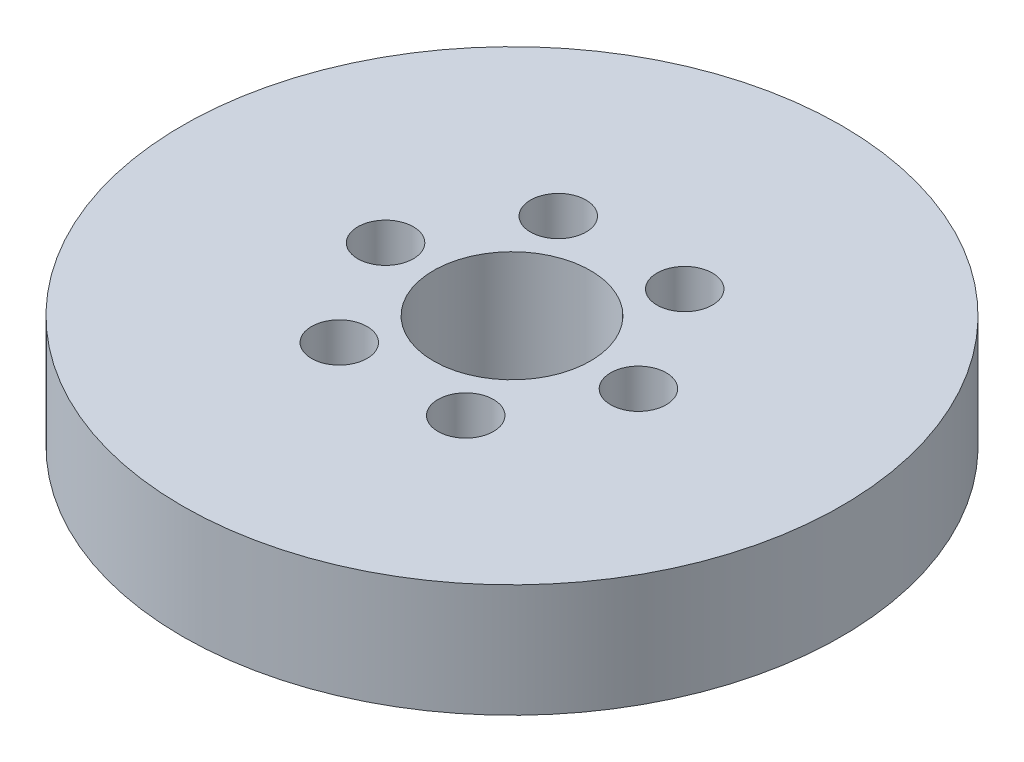
ISO-10303-21;
HEADER;
FILE_DESCRIPTION(('STEP AP214'),'2;1');
FILE_NAME('part.step','',(''),(''),'','','');
FILE_SCHEMA(('AUTOMOTIVE_DESIGN { 1 0 10303 214 1 1 1 1 }'));
ENDSEC;
DATA;
#1=APPLICATION_CONTEXT('core data for automotive mechanical design processes');
#2=APPLICATION_PROTOCOL_DEFINITION('international standard','automotive_design',2000,#1);
#3=PRODUCT_CONTEXT('',#1,'mechanical');
#4=PRODUCT('Part','Part','',(#3));
#5=PRODUCT_RELATED_PRODUCT_CATEGORY('part','',(#4));
#6=PRODUCT_DEFINITION_FORMATION('','',#4);
#7=PRODUCT_DEFINITION_CONTEXT('part definition',#1,'design');
#8=PRODUCT_DEFINITION('design','',#6,#7);
#9=PRODUCT_DEFINITION_SHAPE('','',#8);
#10=(LENGTH_UNIT() NAMED_UNIT(*) SI_UNIT(.MILLI.,.METRE.));
#11=(NAMED_UNIT(*) PLANE_ANGLE_UNIT() SI_UNIT($,.RADIAN.));
#12=(NAMED_UNIT(*) SI_UNIT($,.STERADIAN.) SOLID_ANGLE_UNIT());
#13=UNCERTAINTY_MEASURE_WITH_UNIT(LENGTH_MEASURE(1.E-05),#10,'distance_accuracy_value','');
#14=(GEOMETRIC_REPRESENTATION_CONTEXT(3) GLOBAL_UNCERTAINTY_ASSIGNED_CONTEXT((#13)) GLOBAL_UNIT_ASSIGNED_CONTEXT((#10,
#11,#12)) REPRESENTATION_CONTEXT('',''));
#15=CARTESIAN_POINT('',(0.,0.,0.));
#16=DIRECTION('',(0.,0.,1.));
#17=DIRECTION('',(1.,0.,0.));
#18=AXIS2_PLACEMENT_3D('',#15,#16,#17);
#19=CARTESIAN_POINT('',(0.,18.,0.));
#20=DIRECTION('',(0.,-1.,0.));
#21=DIRECTION('',(0.,0.,-1.));
#22=AXIS2_PLACEMENT_3D('',#19,#20,#21);
#23=CYLINDRICAL_SURFACE('',#22,52.5);
#24=CARTESIAN_POINT('',(0.,18.,0.));
#25=DIRECTION('',(0.,1.,0.));
#26=DIRECTION('',(0.,0.,1.));
#27=AXIS2_PLACEMENT_3D('',#24,#25,#26);
#28=CIRCLE('',#27,52.5);
#29=CARTESIAN_POINT('',(0.,18.,52.5));
#30=VERTEX_POINT('',#29);
#31=EDGE_CURVE('E10',#30,#30,#28,.T.);
#32=ORIENTED_EDGE('',*,*,#31,.F.);
#33=EDGE_LOOP('',(#32));
#34=FACE_BOUND('',#33,.T.);
#35=CARTESIAN_POINT('',(0.,0.,0.));
#36=DIRECTION('',(0.,1.,0.));
#37=DIRECTION('',(0.,0.,1.));
#38=AXIS2_PLACEMENT_3D('',#35,#36,#37);
#39=CIRCLE('',#38,52.5);
#40=CARTESIAN_POINT('',(0.,0.,52.5));
#41=VERTEX_POINT('',#40);
#42=EDGE_CURVE('E37',#41,#41,#39,.T.);
#43=ORIENTED_EDGE('',*,*,#42,.T.);
#44=EDGE_LOOP('',(#43));
#45=FACE_BOUND('',#44,.T.);
#46=ADVANCED_FACE('F40',(#34,#45),#23,.T.);
#47=CARTESIAN_POINT('',(0.,18.,0.));
#48=DIRECTION('',(0.,1.,0.));
#49=DIRECTION('',(0.,0.,1.));
#50=AXIS2_PLACEMENT_3D('',#47,#48,#49);
#51=PLANE('',#50);
#52=CARTESIAN_POINT('',(-10.0704465716138,18.,-17.4425251169424));
#53=DIRECTION('',(0.,1.,0.));
#54=DIRECTION('',(-0.866025403784433,0.,0.50000000000001));
#55=AXIS2_PLACEMENT_3D('',#52,#53,#54);
#56=CIRCLE('',#55,4.42404894616587);
#57=CARTESIAN_POINT('',(-13.9017853465792,18.,-15.2305006438594));
#58=VERTEX_POINT('',#57);
#59=EDGE_CURVE('E70',#58,#58,#56,.T.);
#60=ORIENTED_EDGE('',*,*,#59,.F.);
#61=EDGE_LOOP('',(#60));
#62=FACE_BOUND('',#61,.T.);
#63=CARTESIAN_POINT('',(10.0704465716134,18.,-17.4425251169426));
#64=DIRECTION('',(0.,1.,0.));
#65=DIRECTION('',(-0.866025403784443,0.,-0.499999999999992));
#66=AXIS2_PLACEMENT_3D('',#63,#64,#65);
#67=CIRCLE('',#66,4.42404894616587);
#68=CARTESIAN_POINT('',(6.23910779664797,18.,-19.6545495900255));
#69=VERTEX_POINT('',#68);
#70=EDGE_CURVE('E71',#69,#69,#67,.T.);
#71=ORIENTED_EDGE('',*,*,#70,.F.);
#72=EDGE_LOOP('',(#71));
#73=FACE_BOUND('',#72,.T.);
#74=CARTESIAN_POINT('',(20.1408931432271,18.,0.));
#75=DIRECTION('',(0.,1.,0.));
#76=DIRECTION('',(0.,0.,-1.));
#77=AXIS2_PLACEMENT_3D('',#74,#75,#76);
#78=CIRCLE('',#77,4.42404894616587);
#79=CARTESIAN_POINT('',(20.1408931432271,18.,-4.42404894616587));
#80=VERTEX_POINT('',#79);
#81=EDGE_CURVE('E78',#80,#80,#78,.T.);
#82=ORIENTED_EDGE('',*,*,#81,.F.);
#83=EDGE_LOOP('',(#82));
#84=FACE_BOUND('',#83,.T.);
#85=CARTESIAN_POINT('',(10.0704465716137,18.,17.4425251169425));
#86=DIRECTION('',(0.,1.,0.));
#87=DIRECTION('',(0.866025403784436,0.,-0.500000000000004));
#88=AXIS2_PLACEMENT_3D('',#85,#86,#87);
#89=CIRCLE('',#88,4.42404894616587);
#90=CARTESIAN_POINT('',(13.9017853465791,18.,15.2305006438595));
#91=VERTEX_POINT('',#90);
#92=EDGE_CURVE('E84',#91,#91,#89,.T.);
#93=ORIENTED_EDGE('',*,*,#92,.F.);
#94=EDGE_LOOP('',(#93));
#95=FACE_BOUND('',#94,.T.);
#96=CARTESIAN_POINT('',(-10.0704465716135,18.,17.4425251169425));
#97=DIRECTION('',(0.,1.,0.));
#98=DIRECTION('',(0.86602540378444,0.,0.499999999999998));
#99=AXIS2_PLACEMENT_3D('',#96,#97,#98);
#100=CIRCLE('',#99,4.42404894616587);
#101=CARTESIAN_POINT('',(-6.23910779664811,18.,19.6545495900255));
#102=VERTEX_POINT('',#101);
#103=EDGE_CURVE('E61',#102,#102,#100,.T.);
#104=ORIENTED_EDGE('',*,*,#103,.F.);
#105=EDGE_LOOP('',(#104));
#106=FACE_BOUND('',#105,.T.);
#107=CARTESIAN_POINT('',(-20.1408931432271,18.,0.));
#108=DIRECTION('',(0.,1.,0.));
#109=DIRECTION('',(0.,0.,1.));
#110=AXIS2_PLACEMENT_3D('',#107,#108,#109);
#111=CIRCLE('',#110,4.42404894616587);
#112=CARTESIAN_POINT('',(-20.1408931432271,18.,4.42404894616587));
#113=VERTEX_POINT('',#112);
#114=EDGE_CURVE('E54',#113,#113,#111,.T.);
#115=ORIENTED_EDGE('',*,*,#114,.F.);
#116=EDGE_LOOP('',(#115));
#117=FACE_BOUND('',#116,.T.);
#118=CARTESIAN_POINT('',(0.,18.,0.));
#119=DIRECTION('',(0.,1.,0.));
#120=DIRECTION('',(0.,0.,1.));
#121=AXIS2_PLACEMENT_3D('',#118,#119,#120);
#122=CIRCLE('',#121,12.5);
#123=CARTESIAN_POINT('',(0.,18.,12.5));
#124=VERTEX_POINT('',#123);
#125=EDGE_CURVE('E50',#124,#124,#122,.T.);
#126=ORIENTED_EDGE('',*,*,#125,.F.);
#127=EDGE_LOOP('',(#126));
#128=FACE_BOUND('',#127,.T.);
#129=ORIENTED_EDGE('',*,*,#31,.T.);
#130=EDGE_LOOP('',(#129));
#131=FACE_BOUND('',#130,.T.);
#132=ADVANCED_FACE('F99',(#62,#73,#84,#95,#106,#117,#128,#131),#51,.T.);
#133=CARTESIAN_POINT('',(0.,0.,0.));
#134=DIRECTION('',(0.,1.,0.));
#135=DIRECTION('',(0.,0.,1.));
#136=AXIS2_PLACEMENT_3D('',#133,#134,#135);
#137=PLANE('',#136);
#138=CARTESIAN_POINT('',(0.,0.,0.));
#139=DIRECTION('',(0.,1.,0.));
#140=DIRECTION('',(0.,0.,1.));
#141=AXIS2_PLACEMENT_3D('',#138,#139,#140);
#142=CIRCLE('',#141,12.5);
#143=CARTESIAN_POINT('',(0.,0.,12.5));
#144=VERTEX_POINT('',#143);
#145=EDGE_CURVE('E47',#144,#144,#142,.T.);
#146=ORIENTED_EDGE('',*,*,#145,.T.);
#147=EDGE_LOOP('',(#146));
#148=FACE_BOUND('',#147,.T.);
#149=ORIENTED_EDGE('',*,*,#42,.F.);
#150=EDGE_LOOP('',(#149));
#151=FACE_BOUND('',#150,.T.);
#152=ADVANCED_FACE('F103',(#148,#151),#137,.F.);
#153=CARTESIAN_POINT('',(0.,18.,0.));
#154=DIRECTION('',(0.,-1.,0.));
#155=DIRECTION('',(0.,0.,-1.));
#156=AXIS2_PLACEMENT_3D('',#153,#154,#155);
#157=CYLINDRICAL_SURFACE('',#156,12.5);
#158=ORIENTED_EDGE('',*,*,#125,.T.);
#159=EDGE_LOOP('',(#158));
#160=FACE_BOUND('',#159,.T.);
#161=ORIENTED_EDGE('',*,*,#145,.F.);
#162=EDGE_LOOP('',(#161));
#163=FACE_BOUND('',#162,.T.);
#164=ADVANCED_FACE('F115',(#160,#163),#157,.F.);
#165=CARTESIAN_POINT('',(-20.1408931432271,3.33318356867225,0.));
#166=DIRECTION('',(0.,1.,0.));
#167=DIRECTION('',(0.,0.,1.));
#168=AXIS2_PLACEMENT_3D('',#165,#166,#167);
#169=CYLINDRICAL_SURFACE('',#168,4.42404894616587);
#170=CARTESIAN_POINT('',(-20.1408931432271,3.33318356867225,0.));
#171=DIRECTION('',(0.,1.,0.));
#172=DIRECTION('',(0.,0.,1.));
#173=AXIS2_PLACEMENT_3D('',#170,#171,#172);
#174=CIRCLE('',#173,4.42404894616587);
#175=CARTESIAN_POINT('',(-20.1408931432271,3.33318356867225,4.42404894616587));
#176=VERTEX_POINT('',#175);
#177=EDGE_CURVE('E55',#176,#176,#174,.T.);
#178=ORIENTED_EDGE('',*,*,#177,.F.);
#179=EDGE_LOOP('',(#178));
#180=FACE_BOUND('',#179,.T.);
#181=ORIENTED_EDGE('',*,*,#114,.T.);
#182=EDGE_LOOP('',(#181));
#183=FACE_BOUND('',#182,.T.);
#184=ADVANCED_FACE('F113',(#180,#183),#169,.F.);
#185=CARTESIAN_POINT('',(-20.1408931432271,3.33318356867225,0.));
#186=DIRECTION('',(0.,1.,0.));
#187=DIRECTION('',(0.,0.,1.));
#188=AXIS2_PLACEMENT_3D('',#185,#186,#187);
#189=PLANE('',#188);
#190=ORIENTED_EDGE('',*,*,#177,.T.);
#191=EDGE_LOOP('',(#190));
#192=FACE_BOUND('',#191,.T.);
#193=ADVANCED_FACE('F144',(#192),#189,.T.);
#194=CARTESIAN_POINT('',(-10.0704465716135,3.33318356867225,17.4425251169425));
#195=DIRECTION('',(0.,1.,0.));
#196=DIRECTION('',(0.,0.,1.));
#197=AXIS2_PLACEMENT_3D('',#194,#195,#196);
#198=CYLINDRICAL_SURFACE('',#197,4.42404894616587);
#199=CARTESIAN_POINT('',(-10.0704465716135,3.33318356867225,17.4425251169425));
#200=DIRECTION('',(0.,1.,0.));
#201=DIRECTION('',(0.86602540378444,0.,0.499999999999998));
#202=AXIS2_PLACEMENT_3D('',#199,#200,#201);
#203=CIRCLE('',#202,4.42404894616587);
#204=CARTESIAN_POINT('',(-6.23910779664811,3.33318356867225,19.6545495900255));
#205=VERTEX_POINT('',#204);
#206=EDGE_CURVE('E59',#205,#205,#203,.T.);
#207=ORIENTED_EDGE('',*,*,#206,.F.);
#208=EDGE_LOOP('',(#207));
#209=FACE_BOUND('',#208,.T.);
#210=ORIENTED_EDGE('',*,*,#103,.T.);
#211=EDGE_LOOP('',(#210));
#212=FACE_BOUND('',#211,.T.);
#213=ADVANCED_FACE('F153',(#209,#212),#198,.F.);
#214=CARTESIAN_POINT('',(-10.0704465716135,3.33318356867225,17.4425251169425));
#215=DIRECTION('',(0.,1.,0.));
#216=DIRECTION('',(0.86602540378444,0.,0.499999999999998));
#217=AXIS2_PLACEMENT_3D('',#214,#215,#216);
#218=PLANE('',#217);
#219=ORIENTED_EDGE('',*,*,#206,.T.);
#220=EDGE_LOOP('',(#219));
#221=FACE_BOUND('',#220,.T.);
#222=ADVANCED_FACE('F96',(#221),#218,.T.);
#223=CARTESIAN_POINT('',(10.0704465716137,3.33318356867225,17.4425251169425));
#224=DIRECTION('',(0.,1.,0.));
#225=DIRECTION('',(0.,0.,1.));
#226=AXIS2_PLACEMENT_3D('',#223,#224,#225);
#227=CYLINDRICAL_SURFACE('',#226,4.42404894616587);
#228=CARTESIAN_POINT('',(10.0704465716137,3.33318356867225,17.4425251169425));
#229=DIRECTION('',(0.,1.,0.));
#230=DIRECTION('',(0.866025403784436,0.,-0.500000000000004));
#231=AXIS2_PLACEMENT_3D('',#228,#229,#230);
#232=CIRCLE('',#231,4.42404894616587);
#233=CARTESIAN_POINT('',(13.9017853465791,3.33318356867225,15.2305006438595));
#234=VERTEX_POINT('',#233);
#235=EDGE_CURVE('E63',#234,#234,#232,.T.);
#236=ORIENTED_EDGE('',*,*,#235,.F.);
#237=EDGE_LOOP('',(#236));
#238=FACE_BOUND('',#237,.T.);
#239=ORIENTED_EDGE('',*,*,#92,.T.);
#240=EDGE_LOOP('',(#239));
#241=FACE_BOUND('',#240,.T.);
#242=ADVANCED_FACE('F91',(#238,#241),#227,.F.);
#243=CARTESIAN_POINT('',(10.0704465716137,3.33318356867225,17.4425251169425));
#244=DIRECTION('',(0.,1.,0.));
#245=DIRECTION('',(0.866025403784436,0.,-0.500000000000004));
#246=AXIS2_PLACEMENT_3D('',#243,#244,#245);
#247=PLANE('',#246);
#248=ORIENTED_EDGE('',*,*,#235,.T.);
#249=EDGE_LOOP('',(#248));
#250=FACE_BOUND('',#249,.T.);
#251=ADVANCED_FACE('F93',(#250),#247,.T.);
#252=CARTESIAN_POINT('',(20.1408931432271,3.33318356867225,0.));
#253=DIRECTION('',(0.,1.,0.));
#254=DIRECTION('',(0.,0.,1.));
#255=AXIS2_PLACEMENT_3D('',#252,#253,#254);
#256=CYLINDRICAL_SURFACE('',#255,4.42404894616587);
#257=CARTESIAN_POINT('',(20.1408931432271,3.33318356867225,0.));
#258=DIRECTION('',(0.,1.,0.));
#259=DIRECTION('',(0.,0.,-1.));
#260=AXIS2_PLACEMENT_3D('',#257,#258,#259);
#261=CIRCLE('',#260,4.42404894616587);
#262=CARTESIAN_POINT('',(20.1408931432271,3.33318356867225,-4.42404894616587));
#263=VERTEX_POINT('',#262);
#264=EDGE_CURVE('E85',#263,#263,#261,.T.);
#265=ORIENTED_EDGE('',*,*,#264,.F.);
#266=EDGE_LOOP('',(#265));
#267=FACE_BOUND('',#266,.T.);
#268=ORIENTED_EDGE('',*,*,#81,.T.);
#269=EDGE_LOOP('',(#268));
#270=FACE_BOUND('',#269,.T.);
#271=ADVANCED_FACE('F187',(#267,#270),#256,.F.);
#272=CARTESIAN_POINT('',(20.1408931432271,3.33318356867225,0.));
#273=DIRECTION('',(0.,1.,0.));
#274=DIRECTION('',(0.,0.,-1.));
#275=AXIS2_PLACEMENT_3D('',#272,#273,#274);
#276=PLANE('',#275);
#277=ORIENTED_EDGE('',*,*,#264,.T.);
#278=EDGE_LOOP('',(#277));
#279=FACE_BOUND('',#278,.T.);
#280=ADVANCED_FACE('F198',(#279),#276,.T.);
#281=CARTESIAN_POINT('',(10.0704465716134,3.33318356867225,-17.4425251169426));
#282=DIRECTION('',(0.,1.,0.));
#283=DIRECTION('',(0.,0.,1.));
#284=AXIS2_PLACEMENT_3D('',#281,#282,#283);
#285=CYLINDRICAL_SURFACE('',#284,4.42404894616587);
#286=CARTESIAN_POINT('',(10.0704465716134,3.33318356867225,-17.4425251169426));
#287=DIRECTION('',(0.,1.,0.));
#288=DIRECTION('',(-0.866025403784443,0.,-0.499999999999992));
#289=AXIS2_PLACEMENT_3D('',#286,#287,#288);
#290=CIRCLE('',#289,4.42404894616587);
#291=CARTESIAN_POINT('',(6.23910779664797,3.33318356867225,-19.6545495900255));
#292=VERTEX_POINT('',#291);
#293=EDGE_CURVE('E76',#292,#292,#290,.T.);
#294=ORIENTED_EDGE('',*,*,#293,.F.);
#295=EDGE_LOOP('',(#294));
#296=FACE_BOUND('',#295,.T.);
#297=ORIENTED_EDGE('',*,*,#70,.T.);
#298=EDGE_LOOP('',(#297));
#299=FACE_BOUND('',#298,.T.);
#300=ADVANCED_FACE('F202',(#296,#299),#285,.F.);
#301=CARTESIAN_POINT('',(10.0704465716134,3.33318356867225,-17.4425251169426));
#302=DIRECTION('',(0.,1.,0.));
#303=DIRECTION('',(-0.866025403784443,0.,-0.499999999999992));
#304=AXIS2_PLACEMENT_3D('',#301,#302,#303);
#305=PLANE('',#304);
#306=ORIENTED_EDGE('',*,*,#293,.T.);
#307=EDGE_LOOP('',(#306));
#308=FACE_BOUND('',#307,.T.);
#309=ADVANCED_FACE('F212',(#308),#305,.T.);
#310=CARTESIAN_POINT('',(-10.0704465716138,3.33318356867225,-17.4425251169424));
#311=DIRECTION('',(0.,1.,0.));
#312=DIRECTION('',(0.,0.,1.));
#313=AXIS2_PLACEMENT_3D('',#310,#311,#312);
#314=CYLINDRICAL_SURFACE('',#313,4.42404894616587);
#315=CARTESIAN_POINT('',(-10.0704465716138,3.33318356867225,-17.4425251169424));
#316=DIRECTION('',(0.,1.,0.));
#317=DIRECTION('',(-0.866025403784433,0.,0.50000000000001));
#318=AXIS2_PLACEMENT_3D('',#315,#316,#317);
#319=CIRCLE('',#318,4.42404894616587);
#320=CARTESIAN_POINT('',(-13.9017853465792,3.33318356867225,-15.2305006438594));
#321=VERTEX_POINT('',#320);
#322=EDGE_CURVE('E69',#321,#321,#319,.T.);
#323=ORIENTED_EDGE('',*,*,#322,.F.);
#324=EDGE_LOOP('',(#323));
#325=FACE_BOUND('',#324,.T.);
#326=ORIENTED_EDGE('',*,*,#59,.T.);
#327=EDGE_LOOP('',(#326));
#328=FACE_BOUND('',#327,.T.);
#329=ADVANCED_FACE('F224',(#325,#328),#314,.F.);
#330=CARTESIAN_POINT('',(-10.0704465716138,3.33318356867225,-17.4425251169424));
#331=DIRECTION('',(0.,1.,0.));
#332=DIRECTION('',(-0.866025403784433,0.,0.50000000000001));
#333=AXIS2_PLACEMENT_3D('',#330,#331,#332);
#334=PLANE('',#333);
#335=ORIENTED_EDGE('',*,*,#322,.T.);
#336=EDGE_LOOP('',(#335));
#337=FACE_BOUND('',#336,.T.);
#338=ADVANCED_FACE('F235',(#337),#334,.T.);
#339=CLOSED_SHELL('',(#46,#132,#152,#164,#184,#193,#213,#222,#242,#251,#271,#280,#300,#309,#329,#338));
#340=MANIFOLD_SOLID_BREP('B2',#339);
#341=ADVANCED_BREP_SHAPE_REPRESENTATION('',(#18,#340),#14);
#342=SHAPE_DEFINITION_REPRESENTATION(#9,#341);
ENDSEC;
END-ISO-10303-21;
